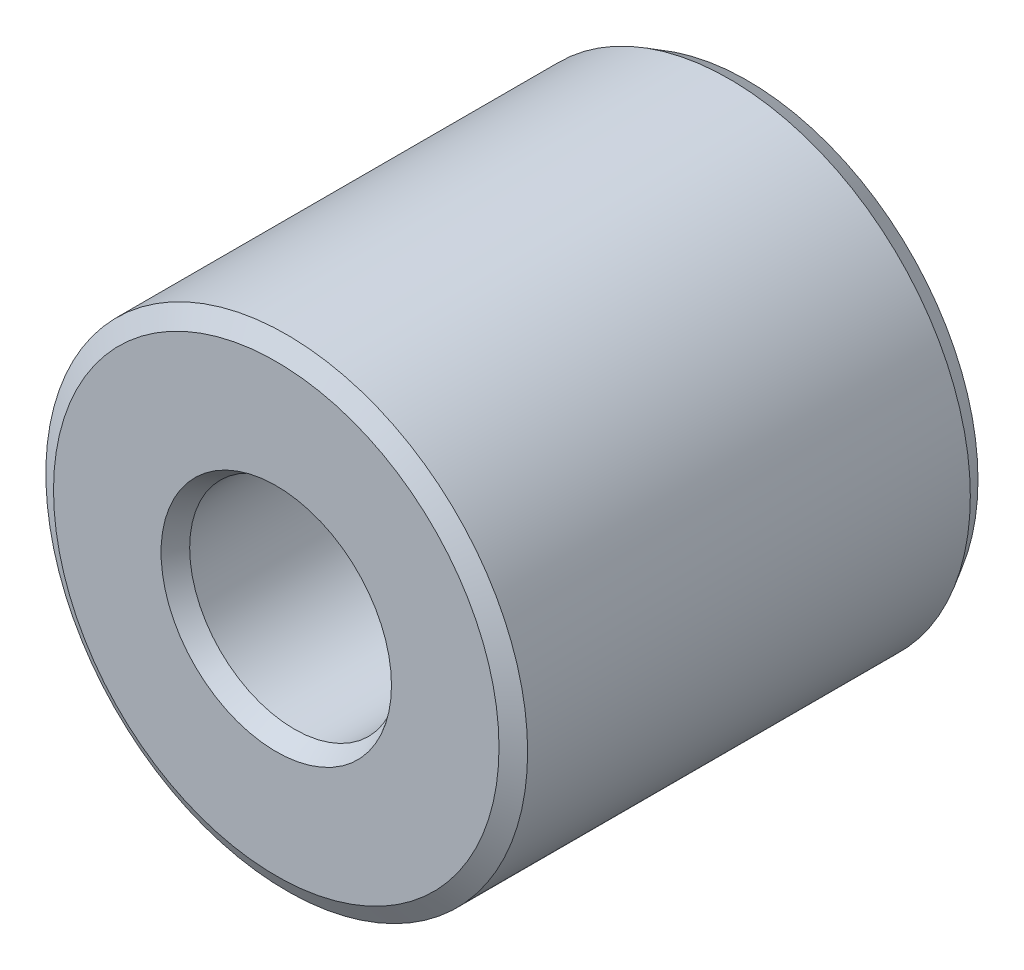
ISO-10303-21;
HEADER;
FILE_DESCRIPTION(('STEP AP214'),'2;1');
FILE_NAME('part.step','',(''),(''),'','','');
FILE_SCHEMA(('AUTOMOTIVE_DESIGN { 1 0 10303 214 1 1 1 1 }'));
ENDSEC;
DATA;
#1=APPLICATION_CONTEXT('core data for automotive mechanical design processes');
#2=APPLICATION_PROTOCOL_DEFINITION('international standard','automotive_design',2000,#1);
#3=PRODUCT_CONTEXT('',#1,'mechanical');
#4=PRODUCT('Part','Part','',(#3));
#5=PRODUCT_RELATED_PRODUCT_CATEGORY('part','',(#4));
#6=PRODUCT_DEFINITION_FORMATION('','',#4);
#7=PRODUCT_DEFINITION_CONTEXT('part definition',#1,'design');
#8=PRODUCT_DEFINITION('design','',#6,#7);
#9=PRODUCT_DEFINITION_SHAPE('','',#8);
#10=(LENGTH_UNIT() NAMED_UNIT(*) SI_UNIT(.MILLI.,.METRE.));
#11=(NAMED_UNIT(*) PLANE_ANGLE_UNIT() SI_UNIT($,.RADIAN.));
#12=(NAMED_UNIT(*) SI_UNIT($,.STERADIAN.) SOLID_ANGLE_UNIT());
#13=UNCERTAINTY_MEASURE_WITH_UNIT(LENGTH_MEASURE(1.E-05),#10,'distance_accuracy_value','');
#14=(GEOMETRIC_REPRESENTATION_CONTEXT(3) GLOBAL_UNCERTAINTY_ASSIGNED_CONTEXT((#13)) GLOBAL_UNIT_ASSIGNED_CONTEXT((#10,
#11,#12)) REPRESENTATION_CONTEXT('',''));
#15=CARTESIAN_POINT('',(0.,0.,0.));
#16=DIRECTION('',(0.,0.,1.));
#17=DIRECTION('',(1.,0.,0.));
#18=AXIS2_PLACEMENT_3D('',#15,#16,#17);
#19=CARTESIAN_POINT('',(0.,0.,4.5));
#20=DIRECTION('',(0.,0.,1.));
#21=DIRECTION('',(1.,0.,0.));
#22=AXIS2_PLACEMENT_3D('',#19,#20,#21);
#23=PLANE('',#22);
#24=CARTESIAN_POINT('',(0.,0.,4.5));
#25=DIRECTION('',(0.,0.,1.));
#26=DIRECTION('',(1.,0.,0.));
#27=AXIS2_PLACEMENT_3D('',#24,#25,#26);
#28=CIRCLE('',#27,2.12679491924311);
#29=CARTESIAN_POINT('',(2.12679491924311,0.,4.5));
#30=VERTEX_POINT('',#29);
#31=EDGE_CURVE('E46',#30,#30,#28,.T.);
#32=ORIENTED_EDGE('',*,*,#31,.T.);
#33=EDGE_LOOP('',(#32));
#34=FACE_BOUND('',#33,.T.);
#35=CARTESIAN_POINT('',(0.,0.,4.5));
#36=DIRECTION('',(0.,0.,1.));
#37=DIRECTION('',(1.,0.,0.));
#38=AXIS2_PLACEMENT_3D('',#35,#36,#37);
#39=CIRCLE('',#38,1.1);
#40=CARTESIAN_POINT('',(1.1,0.,4.5));
#41=VERTEX_POINT('',#40);
#42=EDGE_CURVE('E50',#41,#41,#39,.F.);
#43=ORIENTED_EDGE('',*,*,#42,.T.);
#44=EDGE_LOOP('',(#43));
#45=FACE_BOUND('',#44,.T.);
#46=ADVANCED_FACE('F35',(#34,#45),#23,.T.);
#47=CARTESIAN_POINT('',(0.,0.,0.));
#48=DIRECTION('',(0.,0.,1.));
#49=DIRECTION('',(1.,0.,0.));
#50=AXIS2_PLACEMENT_3D('',#47,#48,#49);
#51=PLANE('',#50);
#52=CARTESIAN_POINT('',(0.,0.,0.));
#53=DIRECTION('',(0.,0.,1.));
#54=DIRECTION('',(1.,0.,0.));
#55=AXIS2_PLACEMENT_3D('',#52,#53,#54);
#56=CIRCLE('',#55,2.2);
#57=CARTESIAN_POINT('',(2.2,0.,0.));
#58=VERTEX_POINT('',#57);
#59=EDGE_CURVE('E55',#58,#58,#56,.F.);
#60=ORIENTED_EDGE('',*,*,#59,.T.);
#61=EDGE_LOOP('',(#60));
#62=FACE_BOUND('',#61,.T.);
#63=CARTESIAN_POINT('',(0.,0.,0.));
#64=DIRECTION('',(0.,0.,1.));
#65=DIRECTION('',(1.,0.,0.));
#66=AXIS2_PLACEMENT_3D('',#63,#64,#65);
#67=CIRCLE('',#66,1.17320508075689);
#68=CARTESIAN_POINT('',(1.17320508075689,0.,0.));
#69=VERTEX_POINT('',#68);
#70=EDGE_CURVE('E58',#69,#69,#67,.T.);
#71=ORIENTED_EDGE('',*,*,#70,.T.);
#72=EDGE_LOOP('',(#71));
#73=FACE_BOUND('',#72,.T.);
#74=ADVANCED_FACE('F80',(#62,#73),#51,.F.);
#75=CARTESIAN_POINT('',(0.,0.,4.5));
#76=DIRECTION('',(0.,0.,-1.));
#77=DIRECTION('',(-1.,0.,0.));
#78=AXIS2_PLACEMENT_3D('',#75,#76,#77);
#79=CYLINDRICAL_SURFACE('',#78,2.3);
#80=CARTESIAN_POINT('',(0.,0.,0.173205080756886));
#81=DIRECTION('',(0.,0.,1.));
#82=DIRECTION('',(1.,0.,0.));
#83=AXIS2_PLACEMENT_3D('',#80,#81,#82);
#84=CIRCLE('',#83,2.3);
#85=CARTESIAN_POINT('',(2.3,0.,0.173205080756886));
#86=VERTEX_POINT('',#85);
#87=EDGE_CURVE('E61',#86,#86,#84,.T.);
#88=ORIENTED_EDGE('',*,*,#87,.T.);
#89=EDGE_LOOP('',(#88));
#90=FACE_BOUND('',#89,.T.);
#91=CARTESIAN_POINT('',(0.,0.,4.4));
#92=DIRECTION('',(0.,0.,1.));
#93=DIRECTION('',(1.,0.,0.));
#94=AXIS2_PLACEMENT_3D('',#91,#92,#93);
#95=CIRCLE('',#94,2.3);
#96=CARTESIAN_POINT('',(2.3,0.,4.4));
#97=VERTEX_POINT('',#96);
#98=EDGE_CURVE('E64',#97,#97,#95,.F.);
#99=ORIENTED_EDGE('',*,*,#98,.T.);
#100=EDGE_LOOP('',(#99));
#101=FACE_BOUND('',#100,.T.);
#102=ADVANCED_FACE('F68',(#90,#101),#79,.T.);
#103=CARTESIAN_POINT('',(0.,0.,4.5));
#104=DIRECTION('',(0.,0.,-1.));
#105=DIRECTION('',(-1.,0.,0.));
#106=AXIS2_PLACEMENT_3D('',#103,#104,#105);
#107=CYLINDRICAL_SURFACE('',#106,1.);
#108=CARTESIAN_POINT('',(0.,0.,0.1));
#109=DIRECTION('',(0.,0.,1.));
#110=DIRECTION('',(1.,0.,0.));
#111=AXIS2_PLACEMENT_3D('',#108,#109,#110);
#112=CIRCLE('',#111,1.);
#113=CARTESIAN_POINT('',(1.,0.,0.1));
#114=VERTEX_POINT('',#113);
#115=EDGE_CURVE('E10',#114,#114,#112,.F.);
#116=ORIENTED_EDGE('',*,*,#115,.T.);
#117=EDGE_LOOP('',(#116));
#118=FACE_BOUND('',#117,.T.);
#119=CARTESIAN_POINT('',(0.,0.,4.32679491924311));
#120=DIRECTION('',(0.,0.,1.));
#121=DIRECTION('',(1.,0.,0.));
#122=AXIS2_PLACEMENT_3D('',#119,#120,#121);
#123=CIRCLE('',#122,1.);
#124=CARTESIAN_POINT('',(1.,0.,4.32679491924311));
#125=VERTEX_POINT('',#124);
#126=EDGE_CURVE('E42',#125,#125,#123,.T.);
#127=ORIENTED_EDGE('',*,*,#126,.T.);
#128=EDGE_LOOP('',(#127));
#129=FACE_BOUND('',#128,.T.);
#130=ADVANCED_FACE('F96',(#118,#129),#107,.F.);
#131=CARTESIAN_POINT('',(0.,0.,0.173205080756886));
#132=DIRECTION('',(0.,0.,1.));
#133=DIRECTION('',(1.,0.,0.));
#134=AXIS2_PLACEMENT_3D('',#131,#132,#133);
#135=CONICAL_SURFACE('',#134,2.3,0.5235987755983);
#136=ORIENTED_EDGE('',*,*,#59,.F.);
#137=EDGE_LOOP('',(#136));
#138=FACE_BOUND('',#137,.T.);
#139=ORIENTED_EDGE('',*,*,#87,.F.);
#140=EDGE_LOOP('',(#139));
#141=FACE_BOUND('',#140,.T.);
#142=ADVANCED_FACE('F74',(#138,#141),#135,.T.);
#143=CARTESIAN_POINT('',(0.,0.,4.5));
#144=DIRECTION('',(0.,0.,-1.));
#145=DIRECTION('',(-1.,0.,0.));
#146=AXIS2_PLACEMENT_3D('',#143,#144,#145);
#147=CONICAL_SURFACE('',#146,2.12679491924311,1.0471975511966);
#148=ORIENTED_EDGE('',*,*,#98,.F.);
#149=EDGE_LOOP('',(#148));
#150=FACE_BOUND('',#149,.T.);
#151=ORIENTED_EDGE('',*,*,#31,.F.);
#152=EDGE_LOOP('',(#151));
#153=FACE_BOUND('',#152,.T.);
#154=ADVANCED_FACE('F70',(#150,#153),#147,.T.);
#155=CARTESIAN_POINT('',(0.,0.,0.));
#156=DIRECTION('',(0.,0.,-1.));
#157=DIRECTION('',(-1.,0.,0.));
#158=AXIS2_PLACEMENT_3D('',#155,#156,#157);
#159=CONICAL_SURFACE('',#158,1.17320508075689,1.0471975511966);
#160=ORIENTED_EDGE('',*,*,#115,.F.);
#161=EDGE_LOOP('',(#160));
#162=FACE_BOUND('',#161,.T.);
#163=ORIENTED_EDGE('',*,*,#70,.F.);
#164=EDGE_LOOP('',(#163));
#165=FACE_BOUND('',#164,.T.);
#166=ADVANCED_FACE('F73',(#162,#165),#159,.F.);
#167=CARTESIAN_POINT('',(0.,0.,4.32679491924311));
#168=DIRECTION('',(0.,0.,1.));
#169=DIRECTION('',(1.,0.,0.));
#170=AXIS2_PLACEMENT_3D('',#167,#168,#169);
#171=CONICAL_SURFACE('',#170,1.,0.523598775598298);
#172=ORIENTED_EDGE('',*,*,#42,.F.);
#173=EDGE_LOOP('',(#172));
#174=FACE_BOUND('',#173,.T.);
#175=ORIENTED_EDGE('',*,*,#126,.F.);
#176=EDGE_LOOP('',(#175));
#177=FACE_BOUND('',#176,.T.);
#178=ADVANCED_FACE('F37',(#174,#177),#171,.F.);
#179=CLOSED_SHELL('',(#46,#74,#102,#130,#142,#154,#166,#178));
#180=MANIFOLD_SOLID_BREP('B2',#179);
#181=ADVANCED_BREP_SHAPE_REPRESENTATION('',(#18,#180),#14);
#182=SHAPE_DEFINITION_REPRESENTATION(#9,#181);
ENDSEC;
END-ISO-10303-21;
